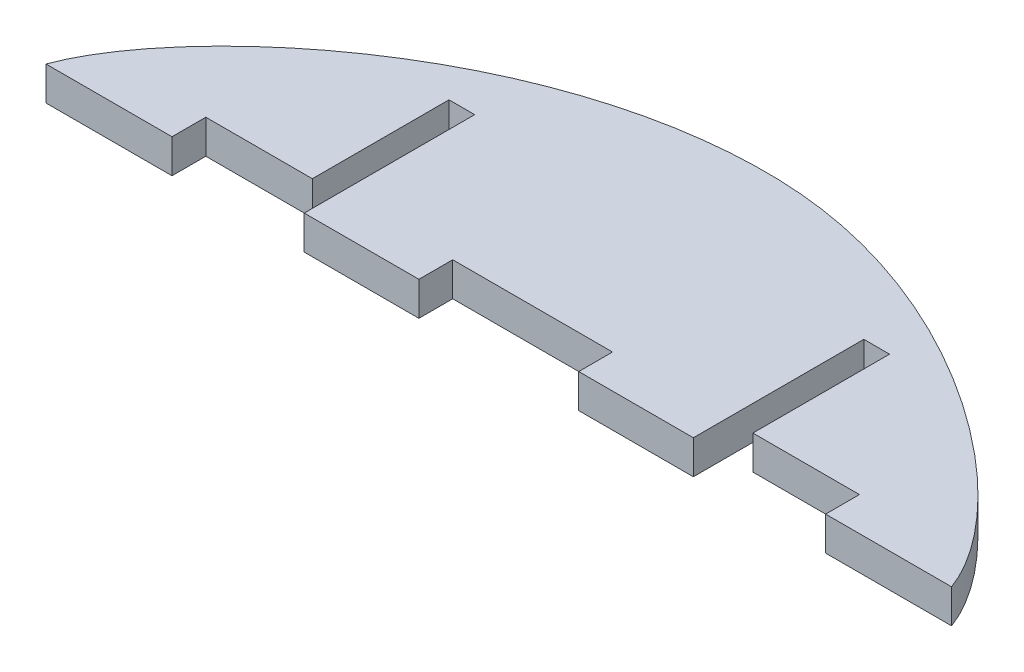
ISO-10303-21;
HEADER;
FILE_DESCRIPTION(('STEP AP214'),'2;1');
FILE_NAME('part.step','',(''),(''),'','','');
FILE_SCHEMA(('AUTOMOTIVE_DESIGN { 1 0 10303 214 1 1 1 1 }'));
ENDSEC;
DATA;
#1=APPLICATION_CONTEXT('core data for automotive mechanical design processes');
#2=APPLICATION_PROTOCOL_DEFINITION('international standard','automotive_design',2000,#1);
#3=PRODUCT_CONTEXT('',#1,'mechanical');
#4=PRODUCT('Part','Part','',(#3));
#5=PRODUCT_RELATED_PRODUCT_CATEGORY('part','',(#4));
#6=PRODUCT_DEFINITION_FORMATION('','',#4);
#7=PRODUCT_DEFINITION_CONTEXT('part definition',#1,'design');
#8=PRODUCT_DEFINITION('design','',#6,#7);
#9=PRODUCT_DEFINITION_SHAPE('','',#8);
#10=(LENGTH_UNIT() NAMED_UNIT(*) SI_UNIT(.MILLI.,.METRE.));
#11=(NAMED_UNIT(*) PLANE_ANGLE_UNIT() SI_UNIT($,.RADIAN.));
#12=(NAMED_UNIT(*) SI_UNIT($,.STERADIAN.) SOLID_ANGLE_UNIT());
#13=UNCERTAINTY_MEASURE_WITH_UNIT(LENGTH_MEASURE(1.E-05),#10,'distance_accuracy_value','');
#14=(GEOMETRIC_REPRESENTATION_CONTEXT(3) GLOBAL_UNCERTAINTY_ASSIGNED_CONTEXT((#13)) GLOBAL_UNIT_ASSIGNED_CONTEXT((#10,
#11,#12)) REPRESENTATION_CONTEXT('',''));
#15=CARTESIAN_POINT('',(0.,0.,0.));
#16=DIRECTION('',(0.,0.,1.));
#17=DIRECTION('',(1.,0.,0.));
#18=AXIS2_PLACEMENT_3D('',#15,#16,#17);
#19=CARTESIAN_POINT('',(0.,3.175,0.));
#20=DIRECTION('',(0.,0.,-1.));
#21=DIRECTION('',(-1.,0.,0.));
#22=AXIS2_PLACEMENT_3D('',#19,#20,#21);
#23=PLANE('',#22);
#24=DIRECTION('',(0.,-1.,0.));
#25=VECTOR('',#24,1.);
#26=CARTESIAN_POINT('',(50.,3.175,0.));
#27=LINE('',#26,#25);
#28=CARTESIAN_POINT('',(50.,3.175,0.));
#29=VERTEX_POINT('',#28);
#30=CARTESIAN_POINT('',(50.,0.,0.));
#31=VERTEX_POINT('',#30);
#32=EDGE_CURVE('E241',#29,#31,#27,.T.);
#33=ORIENTED_EDGE('',*,*,#32,.T.);
#34=DIRECTION('',(1.,0.,0.));
#35=VECTOR('',#34,1.);
#36=CARTESIAN_POINT('',(0.,0.,0.));
#37=LINE('',#36,#35);
#38=CARTESIAN_POINT('',(60.7620000000001,0.,0.));
#39=VERTEX_POINT('',#38);
#40=EDGE_CURVE('E200',#31,#39,#37,.T.);
#41=ORIENTED_EDGE('',*,*,#40,.T.);
#42=DIRECTION('',(0.,-1.,0.));
#43=VECTOR('',#42,1.);
#44=CARTESIAN_POINT('',(60.7620000000001,3.175,0.));
#45=LINE('',#44,#43);
#46=CARTESIAN_POINT('',(60.7620000000001,3.175,0.));
#47=VERTEX_POINT('',#46);
#48=EDGE_CURVE('E212',#47,#39,#45,.T.);
#49=ORIENTED_EDGE('',*,*,#48,.F.);
#50=DIRECTION('',(1.,0.,0.));
#51=VECTOR('',#50,1.);
#52=CARTESIAN_POINT('',(0.,3.175,0.));
#53=LINE('',#52,#51);
#54=EDGE_CURVE('E184',#29,#47,#53,.T.);
#55=ORIENTED_EDGE('',*,*,#54,.F.);
#56=EDGE_LOOP('',(#33,#41,#49,#55));
#57=FACE_BOUND('',#56,.T.);
#58=ADVANCED_FACE('F32',(#57),#23,.F.);
#59=CARTESIAN_POINT('',(0.,0.,0.));
#60=VERTEX_POINT('',#59);
#61=CARTESIAN_POINT('',(11.8250000000001,0.,0.));
#62=VERTEX_POINT('',#61);
#63=EDGE_CURVE('E195',#60,#62,#37,.T.);
#64=ORIENTED_EDGE('',*,*,#63,.T.);
#65=DIRECTION('',(0.,-1.,0.));
#66=VECTOR('',#65,1.);
#67=CARTESIAN_POINT('',(11.8250000000001,3.175,0.));
#68=LINE('',#67,#66);
#69=CARTESIAN_POINT('',(11.8250000000001,3.175,0.));
#70=VERTEX_POINT('',#69);
#71=EDGE_CURVE('E261',#70,#62,#68,.T.);
#72=ORIENTED_EDGE('',*,*,#71,.F.);
#73=CARTESIAN_POINT('',(0.,3.175,0.));
#74=VERTEX_POINT('',#73);
#75=EDGE_CURVE('E183',#74,#70,#53,.T.);
#76=ORIENTED_EDGE('',*,*,#75,.F.);
#77=DIRECTION('',(0.,-1.,0.));
#78=VECTOR('',#77,1.);
#79=CARTESIAN_POINT('',(0.,3.175,0.));
#80=LINE('',#79,#78);
#81=EDGE_CURVE('E11',#74,#60,#80,.T.);
#82=ORIENTED_EDGE('',*,*,#81,.T.);
#83=EDGE_LOOP('',(#64,#72,#76,#82));
#84=FACE_BOUND('',#83,.T.);
#85=ADVANCED_FACE('F347',(#84),#23,.F.);
#86=CARTESIAN_POINT('',(0.,3.175,0.));
#87=DIRECTION('',(0.,1.,0.));
#88=DIRECTION('',(0.,0.,1.));
#89=AXIS2_PLACEMENT_3D('',#86,#87,#88);
#90=PLANE('',#89);
#91=DIRECTION('',(-1.,0.,0.));
#92=VECTOR('',#91,1.);
#93=CARTESIAN_POINT('',(0.,3.175,-3.175));
#94=LINE('',#93,#92);
#95=CARTESIAN_POINT('',(50.,3.175,-3.17499999999999));
#96=VERTEX_POINT('',#95);
#97=CARTESIAN_POINT('',(35.,3.175,-3.17499999999999));
#98=VERTEX_POINT('',#97);
#99=EDGE_CURVE('E165',#96,#98,#94,.T.);
#100=ORIENTED_EDGE('',*,*,#99,.F.);
#101=DIRECTION('',(0.,0.,-1.));
#102=VECTOR('',#101,1.);
#103=CARTESIAN_POINT('',(50.,3.175,0.));
#104=LINE('',#103,#102);
#105=EDGE_CURVE('E176',#29,#96,#104,.T.);
#106=ORIENTED_EDGE('',*,*,#105,.F.);
#107=ORIENTED_EDGE('',*,*,#54,.T.);
#108=DIRECTION('',(0.,0.,1.));
#109=VECTOR('',#108,1.);
#110=CARTESIAN_POINT('',(60.7620000000001,3.175,0.));
#111=LINE('',#110,#109);
#112=CARTESIAN_POINT('',(60.7620000000001,3.175,-16.));
#113=VERTEX_POINT('',#112);
#114=EDGE_CURVE('E250',#113,#47,#111,.T.);
#115=ORIENTED_EDGE('',*,*,#114,.F.);
#116=DIRECTION('',(1.,0.,0.));
#117=VECTOR('',#116,1.);
#118=CARTESIAN_POINT('',(0.,3.175,-16.));
#119=LINE('',#118,#117);
#120=CARTESIAN_POINT('',(63.1750000000001,3.175,-16.));
#121=VERTEX_POINT('',#120);
#122=EDGE_CURVE('E247',#113,#121,#119,.T.);
#123=ORIENTED_EDGE('',*,*,#122,.T.);
#124=DIRECTION('',(0.,0.,1.));
#125=VECTOR('',#124,1.);
#126=CARTESIAN_POINT('',(63.1750000000001,3.175,0.));
#127=LINE('',#126,#125);
#128=CARTESIAN_POINT('',(63.1750000000001,3.175,-3.175));
#129=VERTEX_POINT('',#128);
#130=EDGE_CURVE('E244',#121,#129,#127,.T.);
#131=ORIENTED_EDGE('',*,*,#130,.T.);
#132=DIRECTION('',(1.,0.,0.));
#133=VECTOR('',#132,1.);
#134=CARTESIAN_POINT('',(0.,3.175,-3.175));
#135=LINE('',#134,#133);
#136=CARTESIAN_POINT('',(73.1750000000001,3.175,-3.175));
#137=VERTEX_POINT('',#136);
#138=EDGE_CURVE('E213',#129,#137,#135,.T.);
#139=ORIENTED_EDGE('',*,*,#138,.T.);
#140=DIRECTION('',(0.,0.,-1.));
#141=VECTOR('',#140,1.);
#142=CARTESIAN_POINT('',(73.1750000000001,3.175,0.));
#143=LINE('',#142,#141);
#144=CARTESIAN_POINT('',(73.1750000000001,3.175,0.));
#145=VERTEX_POINT('',#144);
#146=EDGE_CURVE('E228',#145,#137,#143,.T.);
#147=ORIENTED_EDGE('',*,*,#146,.F.);
#148=CARTESIAN_POINT('',(85.,3.175,0.));
#149=VERTEX_POINT('',#148);
#150=EDGE_CURVE('E186',#145,#149,#53,.T.);
#151=ORIENTED_EDGE('',*,*,#150,.T.);
#152=CARTESIAN_POINT('',(0.,3.175,0.));
#153=CARTESIAN_POINT('',(3.07818128993105,3.175,-8.45723358707316));
#154=CARTESIAN_POINT('',(20.6792759746564,3.175,-24.7061706731169));
#155=CARTESIAN_POINT('',(61.0738639115897,3.175,-25.520430415107));
#156=CARTESIAN_POINT('',(81.921818710069,3.175,-8.45723358707316));
#157=CARTESIAN_POINT('',(85.,3.175,0.));
#158=B_SPLINE_CURVE_WITH_KNOTS('',3,(#152,#153,#154,#155,#156,#157),.UNSPECIFIED.,.F.,.F.,(4,1,
1,4),(0.,0.479831935429719,0.579831935429719,1.),.UNSPECIFIED.);
#159=EDGE_CURVE('E189',#74,#149,#158,.T.);
#160=ORIENTED_EDGE('',*,*,#159,.F.);
#161=ORIENTED_EDGE('',*,*,#75,.T.);
#162=DIRECTION('',(0.,0.,-1.));
#163=VECTOR('',#162,1.);
#164=CARTESIAN_POINT('',(11.8250000000001,3.175,0.));
#165=LINE('',#164,#163);
#166=CARTESIAN_POINT('',(11.8250000000001,3.175,-3.175));
#167=VERTEX_POINT('',#166);
#168=EDGE_CURVE('E282',#70,#167,#165,.T.);
#169=ORIENTED_EDGE('',*,*,#168,.T.);
#170=DIRECTION('',(-1.,0.,0.));
#171=VECTOR('',#170,1.);
#172=CARTESIAN_POINT('',(0.,3.175,-3.175));
#173=LINE('',#172,#171);
#174=CARTESIAN_POINT('',(21.8250000000001,3.175,-3.175));
#175=VERTEX_POINT('',#174);
#176=EDGE_CURVE('E257',#175,#167,#173,.T.);
#177=ORIENTED_EDGE('',*,*,#176,.F.);
#178=DIRECTION('',(0.,0.,1.));
#179=VECTOR('',#178,1.);
#180=CARTESIAN_POINT('',(21.8250000000001,3.175,0.));
#181=LINE('',#180,#179);
#182=CARTESIAN_POINT('',(21.8250000000001,3.175,-16.));
#183=VERTEX_POINT('',#182);
#184=EDGE_CURVE('E271',#183,#175,#181,.T.);
#185=ORIENTED_EDGE('',*,*,#184,.F.);
#186=DIRECTION('',(-1.,0.,0.));
#187=VECTOR('',#186,1.);
#188=CARTESIAN_POINT('',(0.,3.175,-16.));
#189=LINE('',#188,#187);
#190=CARTESIAN_POINT('',(24.2380000000001,3.175,-16.));
#191=VERTEX_POINT('',#190);
#192=EDGE_CURVE('E286',#191,#183,#189,.T.);
#193=ORIENTED_EDGE('',*,*,#192,.F.);
#194=DIRECTION('',(0.,0.,1.));
#195=VECTOR('',#194,1.);
#196=CARTESIAN_POINT('',(24.2380000000001,3.175,0.));
#197=LINE('',#196,#195);
#198=CARTESIAN_POINT('',(24.2380000000001,3.175,0.));
#199=VERTEX_POINT('',#198);
#200=EDGE_CURVE('E182',#191,#199,#197,.T.);
#201=ORIENTED_EDGE('',*,*,#200,.T.);
#202=CARTESIAN_POINT('',(35.,3.175,0.));
#203=VERTEX_POINT('',#202);
#204=EDGE_CURVE('E173',#199,#203,#53,.T.);
#205=ORIENTED_EDGE('',*,*,#204,.T.);
#206=DIRECTION('',(0.,0.,-1.));
#207=VECTOR('',#206,1.);
#208=CARTESIAN_POINT('',(35.,3.175,0.));
#209=LINE('',#208,#207);
#210=EDGE_CURVE('E159',#203,#98,#209,.T.);
#211=ORIENTED_EDGE('',*,*,#210,.T.);
#212=EDGE_LOOP('',(#100,#106,#107,#115,#123,#131,#139,#147,#151,#160,#161,#169,#177,#185,#193,
#201,#205,#211));
#213=FACE_BOUND('',#212,.T.);
#214=ADVANCED_FACE('F179',(#213),#90,.T.);
#215=CARTESIAN_POINT('',(0.,0.,0.));
#216=DIRECTION('',(0.,1.,0.));
#217=DIRECTION('',(0.,0.,1.));
#218=AXIS2_PLACEMENT_3D('',#215,#216,#217);
#219=PLANE('',#218);
#220=DIRECTION('',(0.,0.,-1.));
#221=VECTOR('',#220,1.);
#222=CARTESIAN_POINT('',(50.,0.,0.));
#223=LINE('',#222,#221);
#224=CARTESIAN_POINT('',(50.,0.,-3.17499999999999));
#225=VERTEX_POINT('',#224);
#226=EDGE_CURVE('E166',#31,#225,#223,.T.);
#227=ORIENTED_EDGE('',*,*,#226,.T.);
#228=DIRECTION('',(-1.,0.,0.));
#229=VECTOR('',#228,1.);
#230=CARTESIAN_POINT('',(0.,0.,-3.175));
#231=LINE('',#230,#229);
#232=CARTESIAN_POINT('',(35.,0.,-3.17499999999999));
#233=VERTEX_POINT('',#232);
#234=EDGE_CURVE('E296',#225,#233,#231,.T.);
#235=ORIENTED_EDGE('',*,*,#234,.T.);
#236=DIRECTION('',(0.,0.,-1.));
#237=VECTOR('',#236,1.);
#238=CARTESIAN_POINT('',(35.,0.,0.));
#239=LINE('',#238,#237);
#240=CARTESIAN_POINT('',(35.,0.,0.));
#241=VERTEX_POINT('',#240);
#242=EDGE_CURVE('E267',#241,#233,#239,.T.);
#243=ORIENTED_EDGE('',*,*,#242,.F.);
#244=CARTESIAN_POINT('',(24.2380000000001,0.,0.));
#245=VERTEX_POINT('',#244);
#246=EDGE_CURVE('E175',#245,#241,#37,.T.);
#247=ORIENTED_EDGE('',*,*,#246,.F.);
#248=DIRECTION('',(0.,0.,1.));
#249=VECTOR('',#248,1.);
#250=CARTESIAN_POINT('',(24.2380000000001,0.,0.));
#251=LINE('',#250,#249);
#252=CARTESIAN_POINT('',(24.2380000000001,0.,-16.));
#253=VERTEX_POINT('',#252);
#254=EDGE_CURVE('E275',#253,#245,#251,.T.);
#255=ORIENTED_EDGE('',*,*,#254,.F.);
#256=DIRECTION('',(-1.,0.,0.));
#257=VECTOR('',#256,1.);
#258=CARTESIAN_POINT('',(0.,0.,-16.));
#259=LINE('',#258,#257);
#260=CARTESIAN_POINT('',(21.8250000000001,0.,-16.));
#261=VERTEX_POINT('',#260);
#262=EDGE_CURVE('E277',#253,#261,#259,.T.);
#263=ORIENTED_EDGE('',*,*,#262,.T.);
#264=DIRECTION('',(0.,0.,1.));
#265=VECTOR('',#264,1.);
#266=CARTESIAN_POINT('',(21.8250000000001,0.,0.));
#267=LINE('',#266,#265);
#268=CARTESIAN_POINT('',(21.8250000000001,0.,-3.175));
#269=VERTEX_POINT('',#268);
#270=EDGE_CURVE('E48',#261,#269,#267,.T.);
#271=ORIENTED_EDGE('',*,*,#270,.T.);
#272=DIRECTION('',(-1.,0.,0.));
#273=VECTOR('',#272,1.);
#274=CARTESIAN_POINT('',(0.,0.,-3.175));
#275=LINE('',#274,#273);
#276=CARTESIAN_POINT('',(11.8250000000001,0.,-3.175));
#277=VERTEX_POINT('',#276);
#278=EDGE_CURVE('E268',#269,#277,#275,.T.);
#279=ORIENTED_EDGE('',*,*,#278,.T.);
#280=DIRECTION('',(0.,0.,-1.));
#281=VECTOR('',#280,1.);
#282=CARTESIAN_POINT('',(11.8250000000001,0.,0.));
#283=LINE('',#282,#281);
#284=EDGE_CURVE('E272',#62,#277,#283,.T.);
#285=ORIENTED_EDGE('',*,*,#284,.F.);
#286=ORIENTED_EDGE('',*,*,#63,.F.);
#287=CARTESIAN_POINT('',(0.,0.,0.));
#288=CARTESIAN_POINT('',(3.07818128993105,0.,-8.45723358707316));
#289=CARTESIAN_POINT('',(20.6792759746564,0.,-24.7061706731169));
#290=CARTESIAN_POINT('',(61.0738639115897,0.,-25.520430415107));
#291=CARTESIAN_POINT('',(81.921818710069,0.,-8.45723358707316));
#292=CARTESIAN_POINT('',(85.,0.,0.));
#293=B_SPLINE_CURVE_WITH_KNOTS('',3,(#287,#288,#289,#290,#291,#292),.UNSPECIFIED.,.F.,.F.,(4,1,
1,4),(0.,0.479831935429719,0.579831935429719,1.),.UNSPECIFIED.);
#294=CARTESIAN_POINT('',(85.,0.,0.));
#295=VERTEX_POINT('',#294);
#296=EDGE_CURVE('E224',#60,#295,#293,.T.);
#297=ORIENTED_EDGE('',*,*,#296,.T.);
#298=CARTESIAN_POINT('',(73.1750000000001,0.,0.));
#299=VERTEX_POINT('',#298);
#300=EDGE_CURVE('E201',#299,#295,#37,.T.);
#301=ORIENTED_EDGE('',*,*,#300,.F.);
#302=DIRECTION('',(0.,0.,-1.));
#303=VECTOR('',#302,1.);
#304=CARTESIAN_POINT('',(73.1750000000001,0.,0.));
#305=LINE('',#304,#303);
#306=CARTESIAN_POINT('',(73.1750000000001,0.,-3.175));
#307=VERTEX_POINT('',#306);
#308=EDGE_CURVE('E238',#299,#307,#305,.T.);
#309=ORIENTED_EDGE('',*,*,#308,.T.);
#310=DIRECTION('',(1.,0.,0.));
#311=VECTOR('',#310,1.);
#312=CARTESIAN_POINT('',(0.,0.,-3.175));
#313=LINE('',#312,#311);
#314=CARTESIAN_POINT('',(63.1750000000001,0.,-3.175));
#315=VERTEX_POINT('',#314);
#316=EDGE_CURVE('E225',#315,#307,#313,.T.);
#317=ORIENTED_EDGE('',*,*,#316,.F.);
#318=DIRECTION('',(0.,0.,1.));
#319=VECTOR('',#318,1.);
#320=CARTESIAN_POINT('',(63.1750000000001,0.,0.));
#321=LINE('',#320,#319);
#322=CARTESIAN_POINT('',(63.1750000000001,0.,-16.));
#323=VERTEX_POINT('',#322);
#324=EDGE_CURVE('E229',#323,#315,#321,.T.);
#325=ORIENTED_EDGE('',*,*,#324,.F.);
#326=DIRECTION('',(1.,0.,0.));
#327=VECTOR('',#326,1.);
#328=CARTESIAN_POINT('',(0.,0.,-16.));
#329=LINE('',#328,#327);
#330=CARTESIAN_POINT('',(60.7620000000001,0.,-16.));
#331=VERTEX_POINT('',#330);
#332=EDGE_CURVE('E232',#331,#323,#329,.T.);
#333=ORIENTED_EDGE('',*,*,#332,.F.);
#334=DIRECTION('',(0.,0.,1.));
#335=VECTOR('',#334,1.);
#336=CARTESIAN_POINT('',(60.7620000000001,0.,0.));
#337=LINE('',#336,#335);
#338=EDGE_CURVE('E235',#331,#39,#337,.T.);
#339=ORIENTED_EDGE('',*,*,#338,.T.);
#340=ORIENTED_EDGE('',*,*,#40,.F.);
#341=EDGE_LOOP('',(#227,#235,#243,#247,#255,#263,#271,#279,#285,#286,#297,#301,#309,#317,#325,
#333,#339,#340));
#342=FACE_BOUND('',#341,.T.);
#343=ADVANCED_FACE('F317',(#342),#219,.F.);
#344=DIRECTION('',(0.,-1.,0.));
#345=VECTOR('',#344,1.);
#346=CARTESIAN_POINT('',(73.1750000000001,3.175,0.));
#347=LINE('',#346,#345);
#348=EDGE_CURVE('E206',#145,#299,#347,.T.);
#349=ORIENTED_EDGE('',*,*,#348,.T.);
#350=ORIENTED_EDGE('',*,*,#300,.T.);
#351=DIRECTION('',(0.,-1.,0.));
#352=VECTOR('',#351,1.);
#353=CARTESIAN_POINT('',(85.,3.175,0.));
#354=LINE('',#353,#352);
#355=EDGE_CURVE('E41',#149,#295,#354,.T.);
#356=ORIENTED_EDGE('',*,*,#355,.F.);
#357=ORIENTED_EDGE('',*,*,#150,.F.);
#358=EDGE_LOOP('',(#349,#350,#356,#357));
#359=FACE_BOUND('',#358,.T.);
#360=ADVANCED_FACE('F333',(#359),#23,.F.);
#361=ORIENTED_EDGE('',*,*,#246,.T.);
#362=DIRECTION('',(0.,-1.,0.));
#363=VECTOR('',#362,1.);
#364=CARTESIAN_POINT('',(35.,3.175,0.));
#365=LINE('',#364,#363);
#366=EDGE_CURVE('E56',#203,#241,#365,.T.);
#367=ORIENTED_EDGE('',*,*,#366,.F.);
#368=ORIENTED_EDGE('',*,*,#204,.F.);
#369=DIRECTION('',(0.,-1.,0.));
#370=VECTOR('',#369,1.);
#371=CARTESIAN_POINT('',(24.2380000000001,3.175,0.));
#372=LINE('',#371,#370);
#373=EDGE_CURVE('E259',#199,#245,#372,.T.);
#374=ORIENTED_EDGE('',*,*,#373,.T.);
#375=EDGE_LOOP('',(#361,#367,#368,#374));
#376=FACE_BOUND('',#375,.T.);
#377=ADVANCED_FACE('F171',(#376),#23,.F.);
#378=DIRECTION('',(0.,-1.,0.));
#379=VECTOR('',#378,1.);
#380=SURFACE_OF_LINEAR_EXTRUSION('',#158,#379);
#381=ORIENTED_EDGE('',*,*,#296,.F.);
#382=ORIENTED_EDGE('',*,*,#81,.F.);
#383=ORIENTED_EDGE('',*,*,#159,.T.);
#384=ORIENTED_EDGE('',*,*,#355,.T.);
#385=EDGE_LOOP('',(#381,#382,#383,#384));
#386=FACE_BOUND('',#385,.T.);
#387=ADVANCED_FACE('F34',(#386),#380,.T.);
#388=CARTESIAN_POINT('',(73.1750000000001,3.175,0.));
#389=DIRECTION('',(-1.,0.,0.));
#390=DIRECTION('',(0.,0.,1.));
#391=AXIS2_PLACEMENT_3D('',#388,#389,#390);
#392=PLANE('',#391);
#393=ORIENTED_EDGE('',*,*,#308,.F.);
#394=ORIENTED_EDGE('',*,*,#348,.F.);
#395=ORIENTED_EDGE('',*,*,#146,.T.);
#396=DIRECTION('',(0.,-1.,0.));
#397=VECTOR('',#396,1.);
#398=CARTESIAN_POINT('',(73.1750000000001,3.175,-3.175));
#399=LINE('',#398,#397);
#400=EDGE_CURVE('E222',#137,#307,#399,.T.);
#401=ORIENTED_EDGE('',*,*,#400,.T.);
#402=EDGE_LOOP('',(#393,#394,#395,#401));
#403=FACE_BOUND('',#402,.T.);
#404=ADVANCED_FACE('F331',(#403),#392,.T.);
#405=CARTESIAN_POINT('',(0.,3.175,-3.175));
#406=DIRECTION('',(0.,0.,-1.));
#407=DIRECTION('',(-1.,0.,0.));
#408=AXIS2_PLACEMENT_3D('',#405,#406,#407);
#409=PLANE('',#408);
#410=ORIENTED_EDGE('',*,*,#316,.T.);
#411=ORIENTED_EDGE('',*,*,#400,.F.);
#412=ORIENTED_EDGE('',*,*,#138,.F.);
#413=DIRECTION('',(0.,-1.,0.));
#414=VECTOR('',#413,1.);
#415=CARTESIAN_POINT('',(63.1750000000001,3.175,-3.175));
#416=LINE('',#415,#414);
#417=EDGE_CURVE('E220',#129,#315,#416,.T.);
#418=ORIENTED_EDGE('',*,*,#417,.T.);
#419=EDGE_LOOP('',(#410,#411,#412,#418));
#420=FACE_BOUND('',#419,.T.);
#421=ADVANCED_FACE('F329',(#420),#409,.F.);
#422=CARTESIAN_POINT('',(63.1750000000001,3.175,0.));
#423=DIRECTION('',(1.,0.,0.));
#424=DIRECTION('',(0.,0.,-1.));
#425=AXIS2_PLACEMENT_3D('',#422,#423,#424);
#426=PLANE('',#425);
#427=ORIENTED_EDGE('',*,*,#324,.T.);
#428=ORIENTED_EDGE('',*,*,#417,.F.);
#429=ORIENTED_EDGE('',*,*,#130,.F.);
#430=DIRECTION('',(0.,-1.,0.));
#431=VECTOR('',#430,1.);
#432=CARTESIAN_POINT('',(63.1750000000001,3.175,-16.));
#433=LINE('',#432,#431);
#434=EDGE_CURVE('E218',#121,#323,#433,.T.);
#435=ORIENTED_EDGE('',*,*,#434,.T.);
#436=EDGE_LOOP('',(#427,#428,#429,#435));
#437=FACE_BOUND('',#436,.T.);
#438=ADVANCED_FACE('F326',(#437),#426,.F.);
#439=CARTESIAN_POINT('',(0.,3.175,-16.));
#440=DIRECTION('',(0.,0.,-1.));
#441=DIRECTION('',(-1.,0.,0.));
#442=AXIS2_PLACEMENT_3D('',#439,#440,#441);
#443=PLANE('',#442);
#444=ORIENTED_EDGE('',*,*,#332,.T.);
#445=ORIENTED_EDGE('',*,*,#434,.F.);
#446=ORIENTED_EDGE('',*,*,#122,.F.);
#447=DIRECTION('',(0.,-1.,0.));
#448=VECTOR('',#447,1.);
#449=CARTESIAN_POINT('',(60.7620000000001,3.175,-16.));
#450=LINE('',#449,#448);
#451=EDGE_CURVE('E216',#113,#331,#450,.T.);
#452=ORIENTED_EDGE('',*,*,#451,.T.);
#453=EDGE_LOOP('',(#444,#445,#446,#452));
#454=FACE_BOUND('',#453,.T.);
#455=ADVANCED_FACE('F321',(#454),#443,.F.);
#456=CARTESIAN_POINT('',(60.7620000000001,3.175,0.));
#457=DIRECTION('',(1.,0.,0.));
#458=DIRECTION('',(0.,0.,-1.));
#459=AXIS2_PLACEMENT_3D('',#456,#457,#458);
#460=PLANE('',#459);
#461=ORIENTED_EDGE('',*,*,#338,.F.);
#462=ORIENTED_EDGE('',*,*,#451,.F.);
#463=ORIENTED_EDGE('',*,*,#114,.T.);
#464=ORIENTED_EDGE('',*,*,#48,.T.);
#465=EDGE_LOOP('',(#461,#462,#463,#464));
#466=FACE_BOUND('',#465,.T.);
#467=ADVANCED_FACE('F314',(#466),#460,.T.);
#468=CARTESIAN_POINT('',(21.8250000000001,3.175,0.));
#469=DIRECTION('',(1.,0.,0.));
#470=DIRECTION('',(0.,0.,-1.));
#471=AXIS2_PLACEMENT_3D('',#468,#469,#470);
#472=PLANE('',#471);
#473=ORIENTED_EDGE('',*,*,#270,.F.);
#474=DIRECTION('',(0.,-1.,0.));
#475=VECTOR('',#474,1.);
#476=CARTESIAN_POINT('',(21.8250000000001,3.175,-16.));
#477=LINE('',#476,#475);
#478=EDGE_CURVE('E254',#183,#261,#477,.T.);
#479=ORIENTED_EDGE('',*,*,#478,.F.);
#480=ORIENTED_EDGE('',*,*,#184,.T.);
#481=DIRECTION('',(0.,-1.,0.));
#482=VECTOR('',#481,1.);
#483=CARTESIAN_POINT('',(21.8250000000001,3.175,-3.175));
#484=LINE('',#483,#482);
#485=EDGE_CURVE('E265',#175,#269,#484,.T.);
#486=ORIENTED_EDGE('',*,*,#485,.T.);
#487=EDGE_LOOP('',(#473,#479,#480,#486));
#488=FACE_BOUND('',#487,.T.);
#489=ADVANCED_FACE('F356',(#488),#472,.T.);
#490=CARTESIAN_POINT('',(0.,3.175,-3.175));
#491=DIRECTION('',(0.,0.,1.));
#492=DIRECTION('',(1.,0.,0.));
#493=AXIS2_PLACEMENT_3D('',#490,#491,#492);
#494=PLANE('',#493);
#495=ORIENTED_EDGE('',*,*,#278,.F.);
#496=ORIENTED_EDGE('',*,*,#485,.F.);
#497=ORIENTED_EDGE('',*,*,#176,.T.);
#498=DIRECTION('',(0.,-1.,0.));
#499=VECTOR('',#498,1.);
#500=CARTESIAN_POINT('',(11.8250000000001,3.175,-3.175));
#501=LINE('',#500,#499);
#502=EDGE_CURVE('E263',#167,#277,#501,.T.);
#503=ORIENTED_EDGE('',*,*,#502,.T.);
#504=EDGE_LOOP('',(#495,#496,#497,#503));
#505=FACE_BOUND('',#504,.T.);
#506=ADVANCED_FACE('F354',(#505),#494,.T.);
#507=CARTESIAN_POINT('',(11.8250000000001,3.175,0.));
#508=DIRECTION('',(-1.,0.,0.));
#509=DIRECTION('',(0.,0.,1.));
#510=AXIS2_PLACEMENT_3D('',#507,#508,#509);
#511=PLANE('',#510);
#512=ORIENTED_EDGE('',*,*,#284,.T.);
#513=ORIENTED_EDGE('',*,*,#502,.F.);
#514=ORIENTED_EDGE('',*,*,#168,.F.);
#515=ORIENTED_EDGE('',*,*,#71,.T.);
#516=EDGE_LOOP('',(#512,#513,#514,#515));
#517=FACE_BOUND('',#516,.T.);
#518=ADVANCED_FACE('F352',(#517),#511,.F.);
#519=CARTESIAN_POINT('',(24.2380000000001,3.175,0.));
#520=DIRECTION('',(1.,0.,0.));
#521=DIRECTION('',(0.,0.,-1.));
#522=AXIS2_PLACEMENT_3D('',#519,#520,#521);
#523=PLANE('',#522);
#524=ORIENTED_EDGE('',*,*,#254,.T.);
#525=ORIENTED_EDGE('',*,*,#373,.F.);
#526=ORIENTED_EDGE('',*,*,#200,.F.);
#527=DIRECTION('',(0.,-1.,0.));
#528=VECTOR('',#527,1.);
#529=CARTESIAN_POINT('',(24.2380000000001,3.175,-16.));
#530=LINE('',#529,#528);
#531=EDGE_CURVE('E256',#191,#253,#530,.T.);
#532=ORIENTED_EDGE('',*,*,#531,.T.);
#533=EDGE_LOOP('',(#524,#525,#526,#532));
#534=FACE_BOUND('',#533,.T.);
#535=ADVANCED_FACE('F362',(#534),#523,.F.);
#536=CARTESIAN_POINT('',(0.,3.175,-16.));
#537=DIRECTION('',(0.,0.,1.));
#538=DIRECTION('',(1.,0.,0.));
#539=AXIS2_PLACEMENT_3D('',#536,#537,#538);
#540=PLANE('',#539);
#541=ORIENTED_EDGE('',*,*,#262,.F.);
#542=ORIENTED_EDGE('',*,*,#531,.F.);
#543=ORIENTED_EDGE('',*,*,#192,.T.);
#544=ORIENTED_EDGE('',*,*,#478,.T.);
#545=EDGE_LOOP('',(#541,#542,#543,#544));
#546=FACE_BOUND('',#545,.T.);
#547=ADVANCED_FACE('F360',(#546),#540,.T.);
#548=CARTESIAN_POINT('',(50.,3.175,0.));
#549=DIRECTION('',(-1.,0.,0.));
#550=DIRECTION('',(0.,0.,1.));
#551=AXIS2_PLACEMENT_3D('',#548,#549,#550);
#552=PLANE('',#551);
#553=ORIENTED_EDGE('',*,*,#226,.F.);
#554=ORIENTED_EDGE('',*,*,#32,.F.);
#555=ORIENTED_EDGE('',*,*,#105,.T.);
#556=DIRECTION('',(0.,-1.,0.));
#557=VECTOR('',#556,1.);
#558=CARTESIAN_POINT('',(50.,3.175,-3.17499999999999));
#559=LINE('',#558,#557);
#560=EDGE_CURVE('E290',#96,#225,#559,.T.);
#561=ORIENTED_EDGE('',*,*,#560,.T.);
#562=EDGE_LOOP('',(#553,#554,#555,#561));
#563=FACE_BOUND('',#562,.T.);
#564=ADVANCED_FACE('F363',(#563),#552,.T.);
#565=CARTESIAN_POINT('',(0.,3.175,-3.175));
#566=DIRECTION('',(0.,0.,1.));
#567=DIRECTION('',(1.,0.,0.));
#568=AXIS2_PLACEMENT_3D('',#565,#566,#567);
#569=PLANE('',#568);
#570=ORIENTED_EDGE('',*,*,#234,.F.);
#571=ORIENTED_EDGE('',*,*,#560,.F.);
#572=ORIENTED_EDGE('',*,*,#99,.T.);
#573=DIRECTION('',(0.,-1.,0.));
#574=VECTOR('',#573,1.);
#575=CARTESIAN_POINT('',(35.,3.175,-3.17499999999999));
#576=LINE('',#575,#574);
#577=EDGE_CURVE('E161',#98,#233,#576,.T.);
#578=ORIENTED_EDGE('',*,*,#577,.T.);
#579=EDGE_LOOP('',(#570,#571,#572,#578));
#580=FACE_BOUND('',#579,.T.);
#581=ADVANCED_FACE('F304',(#580),#569,.T.);
#582=CARTESIAN_POINT('',(35.,3.175,0.));
#583=DIRECTION('',(-1.,0.,0.));
#584=DIRECTION('',(0.,0.,1.));
#585=AXIS2_PLACEMENT_3D('',#582,#583,#584);
#586=PLANE('',#585);
#587=ORIENTED_EDGE('',*,*,#242,.T.);
#588=ORIENTED_EDGE('',*,*,#577,.F.);
#589=ORIENTED_EDGE('',*,*,#210,.F.);
#590=ORIENTED_EDGE('',*,*,#366,.T.);
#591=EDGE_LOOP('',(#587,#588,#589,#590));
#592=FACE_BOUND('',#591,.T.);
#593=ADVANCED_FACE('F160',(#592),#586,.F.);
#594=CLOSED_SHELL('',(#58,#85,#214,#343,#360,#377,#387,#404,#421,#438,#455,#467,#489,#506,#518,
#535,#547,#564,#581,#593));
#595=MANIFOLD_SOLID_BREP('B2',#594);
#596=ADVANCED_BREP_SHAPE_REPRESENTATION('',(#18,#595),#14);
#597=SHAPE_DEFINITION_REPRESENTATION(#9,#596);
ENDSEC;
END-ISO-10303-21;
